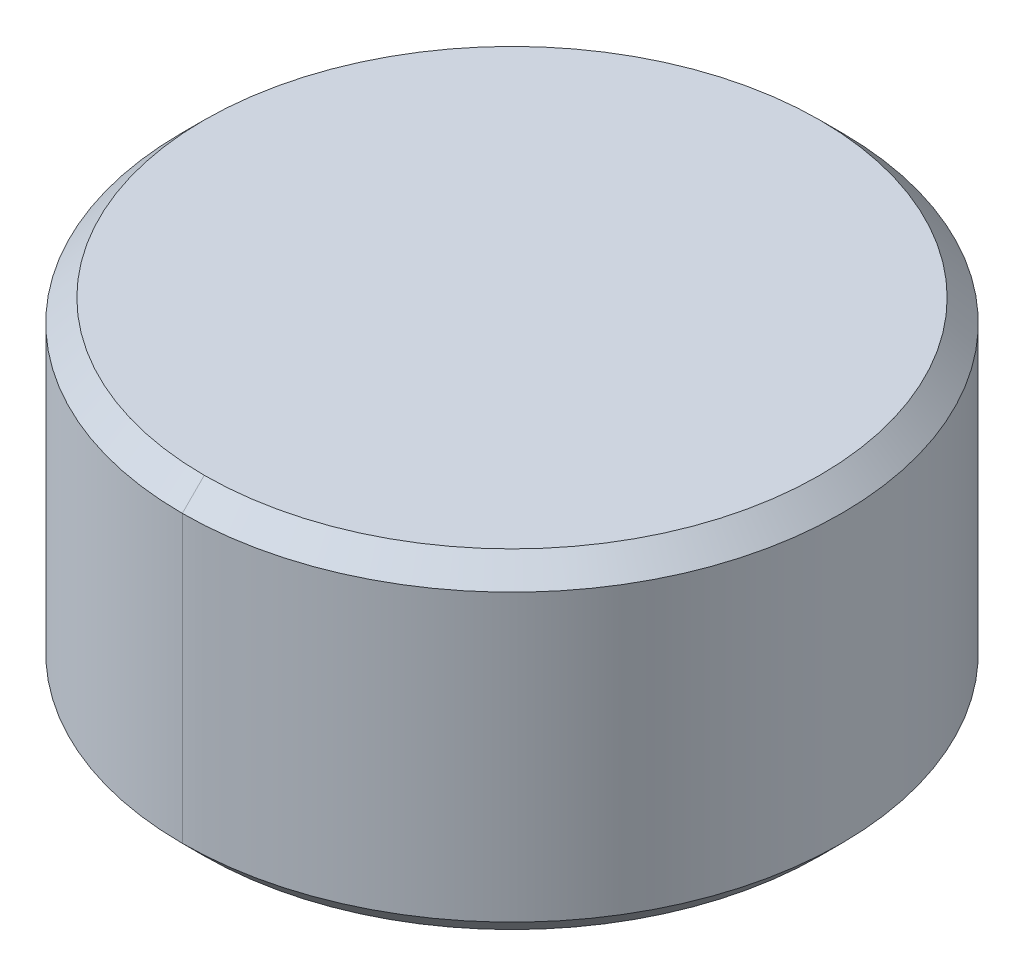
ISO-10303-21;
HEADER;
FILE_DESCRIPTION(('STEP AP214'),'2;1');
FILE_NAME('part.step','',(''),(''),'','','');
FILE_SCHEMA(('AUTOMOTIVE_DESIGN { 1 0 10303 214 1 1 1 1 }'));
ENDSEC;
DATA;
#1=APPLICATION_CONTEXT('core data for automotive mechanical design processes');
#2=APPLICATION_PROTOCOL_DEFINITION('international standard','automotive_design',2000,#1);
#3=PRODUCT_CONTEXT('',#1,'mechanical');
#4=PRODUCT('Part','Part','',(#3));
#5=PRODUCT_RELATED_PRODUCT_CATEGORY('part','',(#4));
#6=PRODUCT_DEFINITION_FORMATION('','',#4);
#7=PRODUCT_DEFINITION_CONTEXT('part definition',#1,'design');
#8=PRODUCT_DEFINITION('design','',#6,#7);
#9=PRODUCT_DEFINITION_SHAPE('','',#8);
#10=(LENGTH_UNIT() NAMED_UNIT(*) SI_UNIT(.MILLI.,.METRE.));
#11=(NAMED_UNIT(*) PLANE_ANGLE_UNIT() SI_UNIT($,.RADIAN.));
#12=(NAMED_UNIT(*) SI_UNIT($,.STERADIAN.) SOLID_ANGLE_UNIT());
#13=UNCERTAINTY_MEASURE_WITH_UNIT(LENGTH_MEASURE(1.E-05),#10,'distance_accuracy_value','');
#14=(GEOMETRIC_REPRESENTATION_CONTEXT(3) GLOBAL_UNCERTAINTY_ASSIGNED_CONTEXT((#13)) GLOBAL_UNIT_ASSIGNED_CONTEXT((#10,
#11,#12)) REPRESENTATION_CONTEXT('',''));
#15=CARTESIAN_POINT('',(0.,0.,0.));
#16=DIRECTION('',(0.,0.,1.));
#17=DIRECTION('',(1.,0.,0.));
#18=AXIS2_PLACEMENT_3D('',#15,#16,#17);
#19=CARTESIAN_POINT('',(0.,3.,0.));
#20=DIRECTION('',(0.,-1.,0.));
#21=DIRECTION('',(0.,0.,-1.));
#22=AXIS2_PLACEMENT_3D('',#19,#20,#21);
#23=CONICAL_SURFACE('',#22,2.8,0.785398163397445);
#24=DIRECTION('',(0.,-0.70710678118655,0.707106781186545));
#25=VECTOR('',#24,1.);
#26=CARTESIAN_POINT('',(0.,3.,2.8));
#27=LINE('',#26,#25);
#28=CARTESIAN_POINT('',(0.,3.,2.8));
#29=VERTEX_POINT('',#28);
#30=CARTESIAN_POINT('',(0.,2.8,3.));
#31=VERTEX_POINT('',#30);
#32=EDGE_CURVE('E72',#29,#31,#27,.T.);
#33=ORIENTED_EDGE('',*,*,#32,.F.);
#34=CARTESIAN_POINT('',(0.,3.,0.));
#35=DIRECTION('',(0.,1.,0.));
#36=DIRECTION('',(0.,0.,1.));
#37=AXIS2_PLACEMENT_3D('',#34,#35,#36);
#38=CIRCLE('',#37,2.8);
#39=CARTESIAN_POINT('',(0.,3.,-2.8));
#40=VERTEX_POINT('',#39);
#41=EDGE_CURVE('E27',#40,#29,#38,.T.);
#42=ORIENTED_EDGE('',*,*,#41,.F.);
#43=DIRECTION('',(0.,-0.70710678118655,-0.707106781186545));
#44=VECTOR('',#43,1.);
#45=CARTESIAN_POINT('',(0.,3.,-2.8));
#46=LINE('',#45,#44);
#47=CARTESIAN_POINT('',(0.,2.8,-3.));
#48=VERTEX_POINT('',#47);
#49=EDGE_CURVE('E81',#40,#48,#46,.T.);
#50=ORIENTED_EDGE('',*,*,#49,.T.);
#51=CARTESIAN_POINT('',(0.,2.8,0.));
#52=DIRECTION('',(0.,-1.,0.));
#53=DIRECTION('',(0.,0.,1.));
#54=AXIS2_PLACEMENT_3D('',#51,#52,#53);
#55=CIRCLE('',#54,3.);
#56=EDGE_CURVE('E74',#31,#48,#55,.T.);
#57=ORIENTED_EDGE('',*,*,#56,.F.);
#58=EDGE_LOOP('',(#33,#42,#50,#57));
#59=FACE_BOUND('',#58,.T.);
#60=ADVANCED_FACE('F16',(#59),#23,.T.);
#61=CARTESIAN_POINT('',(0.,0.2,0.));
#62=DIRECTION('',(0.,1.,0.));
#63=DIRECTION('',(0.,0.,1.));
#64=AXIS2_PLACEMENT_3D('',#61,#62,#63);
#65=CONICAL_SURFACE('',#64,3.,0.78539816339745);
#66=DIRECTION('',(0.,0.707106781186546,-0.707106781186549));
#67=VECTOR('',#66,1.);
#68=CARTESIAN_POINT('',(0.,0.2,-3.));
#69=LINE('',#68,#67);
#70=CARTESIAN_POINT('',(0.,0.,-2.8));
#71=VERTEX_POINT('',#70);
#72=CARTESIAN_POINT('',(0.,0.2,-3.));
#73=VERTEX_POINT('',#72);
#74=EDGE_CURVE('E87',#71,#73,#69,.T.);
#75=ORIENTED_EDGE('',*,*,#74,.F.);
#76=CARTESIAN_POINT('',(0.,0.,0.));
#77=DIRECTION('',(0.,-1.,0.));
#78=DIRECTION('',(0.,0.,1.));
#79=AXIS2_PLACEMENT_3D('',#76,#77,#78);
#80=CIRCLE('',#79,2.8);
#81=CARTESIAN_POINT('',(0.,0.,2.8));
#82=VERTEX_POINT('',#81);
#83=EDGE_CURVE('E11',#82,#71,#80,.T.);
#84=ORIENTED_EDGE('',*,*,#83,.F.);
#85=DIRECTION('',(0.,0.707106781186546,0.707106781186549));
#86=VECTOR('',#85,1.);
#87=CARTESIAN_POINT('',(0.,0.2,3.));
#88=LINE('',#87,#86);
#89=CARTESIAN_POINT('',(0.,0.2,3.));
#90=VERTEX_POINT('',#89);
#91=EDGE_CURVE('E20',#82,#90,#88,.T.);
#92=ORIENTED_EDGE('',*,*,#91,.T.);
#93=CARTESIAN_POINT('',(0.,0.2,0.));
#94=DIRECTION('',(0.,1.,0.));
#95=DIRECTION('',(0.,0.,1.));
#96=AXIS2_PLACEMENT_3D('',#93,#94,#95);
#97=CIRCLE('',#96,3.);
#98=EDGE_CURVE('E42',#73,#90,#97,.T.);
#99=ORIENTED_EDGE('',*,*,#98,.F.);
#100=EDGE_LOOP('',(#75,#84,#92,#99));
#101=FACE_BOUND('',#100,.T.);
#102=ADVANCED_FACE('F136',(#101),#65,.T.);
#103=CARTESIAN_POINT('',(0.,0.,0.));
#104=DIRECTION('',(0.,1.,0.));
#105=DIRECTION('',(1.,0.,0.));
#106=AXIS2_PLACEMENT_3D('',#103,#104,#105);
#107=PLANE('',#106);
#108=ORIENTED_EDGE('',*,*,#83,.T.);
#109=CARTESIAN_POINT('',(0.,0.,0.));
#110=DIRECTION('',(0.,-1.,0.));
#111=DIRECTION('',(0.,0.,1.));
#112=AXIS2_PLACEMENT_3D('',#109,#110,#111);
#113=CIRCLE('',#112,2.8);
#114=EDGE_CURVE('E92',#71,#82,#113,.T.);
#115=ORIENTED_EDGE('',*,*,#114,.T.);
#116=EDGE_LOOP('',(#108,#115));
#117=FACE_BOUND('',#116,.T.);
#118=ADVANCED_FACE('F141',(#117),#107,.F.);
#119=CARTESIAN_POINT('',(0.,3.,0.));
#120=DIRECTION('',(0.,1.,0.));
#121=DIRECTION('',(1.,0.,0.));
#122=AXIS2_PLACEMENT_3D('',#119,#120,#121);
#123=PLANE('',#122);
#124=ORIENTED_EDGE('',*,*,#41,.T.);
#125=CARTESIAN_POINT('',(0.,3.,0.));
#126=DIRECTION('',(0.,1.,0.));
#127=DIRECTION('',(0.,0.,1.));
#128=AXIS2_PLACEMENT_3D('',#125,#126,#127);
#129=CIRCLE('',#128,2.8);
#130=EDGE_CURVE('E64',#29,#40,#129,.T.);
#131=ORIENTED_EDGE('',*,*,#130,.T.);
#132=EDGE_LOOP('',(#124,#131));
#133=FACE_BOUND('',#132,.T.);
#134=ADVANCED_FACE('F62',(#133),#123,.T.);
#135=CARTESIAN_POINT('',(0.,3.,0.));
#136=DIRECTION('',(0.,-1.,0.));
#137=DIRECTION('',(0.,0.,-1.));
#138=AXIS2_PLACEMENT_3D('',#135,#136,#137);
#139=CYLINDRICAL_SURFACE('',#138,3.);
#140=DIRECTION('',(0.,-1.,0.));
#141=VECTOR('',#140,1.);
#142=CARTESIAN_POINT('',(0.,3.,3.));
#143=LINE('',#142,#141);
#144=EDGE_CURVE('E96',#31,#90,#143,.T.);
#145=ORIENTED_EDGE('',*,*,#144,.F.);
#146=ORIENTED_EDGE('',*,*,#56,.T.);
#147=DIRECTION('',(0.,-1.,0.));
#148=VECTOR('',#147,1.);
#149=CARTESIAN_POINT('',(0.,3.,-3.));
#150=LINE('',#149,#148);
#151=EDGE_CURVE('E93',#48,#73,#150,.T.);
#152=ORIENTED_EDGE('',*,*,#151,.T.);
#153=ORIENTED_EDGE('',*,*,#98,.T.);
#154=EDGE_LOOP('',(#145,#146,#152,#153));
#155=FACE_BOUND('',#154,.T.);
#156=ADVANCED_FACE('F148',(#155),#139,.T.);
#157=CARTESIAN_POINT('',(0.,3.,0.));
#158=DIRECTION('',(0.,-1.,0.));
#159=DIRECTION('',(0.,0.,-1.));
#160=AXIS2_PLACEMENT_3D('',#157,#158,#159);
#161=CYLINDRICAL_SURFACE('',#160,3.);
#162=CARTESIAN_POINT('',(0.,2.8,0.));
#163=DIRECTION('',(0.,-1.,0.));
#164=DIRECTION('',(0.,0.,1.));
#165=AXIS2_PLACEMENT_3D('',#162,#163,#164);
#166=CIRCLE('',#165,3.);
#167=EDGE_CURVE('E78',#48,#31,#166,.T.);
#168=ORIENTED_EDGE('',*,*,#167,.T.);
#169=ORIENTED_EDGE('',*,*,#144,.T.);
#170=CARTESIAN_POINT('',(0.,0.2,0.));
#171=DIRECTION('',(0.,1.,0.));
#172=DIRECTION('',(0.,0.,1.));
#173=AXIS2_PLACEMENT_3D('',#170,#171,#172);
#174=CIRCLE('',#173,3.);
#175=EDGE_CURVE('E91',#90,#73,#174,.T.);
#176=ORIENTED_EDGE('',*,*,#175,.T.);
#177=ORIENTED_EDGE('',*,*,#151,.F.);
#178=EDGE_LOOP('',(#168,#169,#176,#177));
#179=FACE_BOUND('',#178,.T.);
#180=ADVANCED_FACE('F118',(#179),#161,.T.);
#181=CARTESIAN_POINT('',(0.,0.2,0.));
#182=DIRECTION('',(0.,1.,0.));
#183=DIRECTION('',(0.,0.,1.));
#184=AXIS2_PLACEMENT_3D('',#181,#182,#183);
#185=CONICAL_SURFACE('',#184,3.,0.78539816339745);
#186=ORIENTED_EDGE('',*,*,#114,.F.);
#187=ORIENTED_EDGE('',*,*,#74,.T.);
#188=ORIENTED_EDGE('',*,*,#175,.F.);
#189=ORIENTED_EDGE('',*,*,#91,.F.);
#190=EDGE_LOOP('',(#186,#187,#188,#189));
#191=FACE_BOUND('',#190,.T.);
#192=ADVANCED_FACE('F18',(#191),#185,.T.);
#193=CARTESIAN_POINT('',(0.,3.,0.));
#194=DIRECTION('',(0.,-1.,0.));
#195=DIRECTION('',(0.,0.,-1.));
#196=AXIS2_PLACEMENT_3D('',#193,#194,#195);
#197=CONICAL_SURFACE('',#196,2.8,0.785398163397445);
#198=ORIENTED_EDGE('',*,*,#130,.F.);
#199=ORIENTED_EDGE('',*,*,#32,.T.);
#200=ORIENTED_EDGE('',*,*,#167,.F.);
#201=ORIENTED_EDGE('',*,*,#49,.F.);
#202=EDGE_LOOP('',(#198,#199,#200,#201));
#203=FACE_BOUND('',#202,.T.);
#204=ADVANCED_FACE('F80',(#203),#197,.T.);
#205=CLOSED_SHELL('',(#60,#102,#118,#134,#156,#180,#192,#204));
#206=MANIFOLD_SOLID_BREP('B1',#205);
#207=ADVANCED_BREP_SHAPE_REPRESENTATION('',(#18,#206),#14);
#208=SHAPE_DEFINITION_REPRESENTATION(#9,#207);
ENDSEC;
END-ISO-10303-21;
